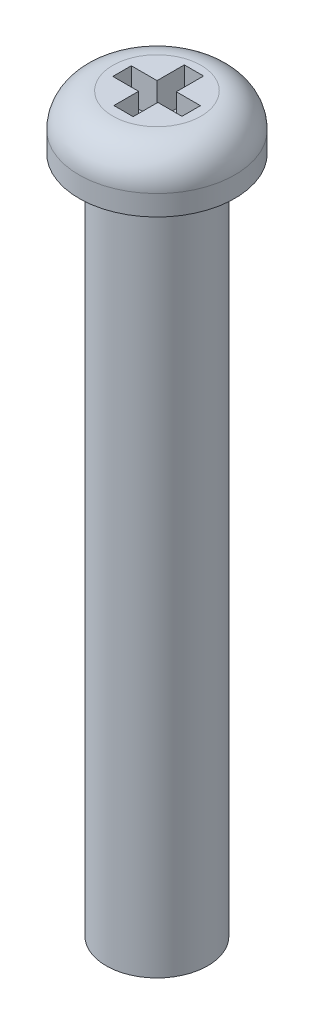
ISO-10303-21;
HEADER;
FILE_DESCRIPTION(('STEP AP214'),'2;1');
FILE_NAME('part.step','',(''),(''),'','','');
FILE_SCHEMA(('AUTOMOTIVE_DESIGN { 1 0 10303 214 1 1 1 1 }'));
ENDSEC;
DATA;
#1=APPLICATION_CONTEXT('core data for automotive mechanical design processes');
#2=APPLICATION_PROTOCOL_DEFINITION('international standard','automotive_design',2000,#1);
#3=PRODUCT_CONTEXT('',#1,'mechanical');
#4=PRODUCT('Part','Part','',(#3));
#5=PRODUCT_RELATED_PRODUCT_CATEGORY('part','',(#4));
#6=PRODUCT_DEFINITION_FORMATION('','',#4);
#7=PRODUCT_DEFINITION_CONTEXT('part definition',#1,'design');
#8=PRODUCT_DEFINITION('design','',#6,#7);
#9=PRODUCT_DEFINITION_SHAPE('','',#8);
#10=(LENGTH_UNIT() NAMED_UNIT(*) SI_UNIT(.MILLI.,.METRE.));
#11=(NAMED_UNIT(*) PLANE_ANGLE_UNIT() SI_UNIT($,.RADIAN.));
#12=(NAMED_UNIT(*) SI_UNIT($,.STERADIAN.) SOLID_ANGLE_UNIT());
#13=UNCERTAINTY_MEASURE_WITH_UNIT(LENGTH_MEASURE(1.E-05),#10,'distance_accuracy_value','');
#14=(GEOMETRIC_REPRESENTATION_CONTEXT(3) GLOBAL_UNCERTAINTY_ASSIGNED_CONTEXT((#13)) GLOBAL_UNIT_ASSIGNED_CONTEXT((#10,
#11,#12)) REPRESENTATION_CONTEXT('',''));
#15=CARTESIAN_POINT('',(0.,0.,0.));
#16=DIRECTION('',(0.,0.,1.));
#17=DIRECTION('',(1.,0.,0.));
#18=AXIS2_PLACEMENT_3D('',#15,#16,#17);
#19=CARTESIAN_POINT('',(0.,0.,0.));
#20=DIRECTION('',(0.,1.,0.));
#21=DIRECTION('',(-1.,0.,0.));
#22=AXIS2_PLACEMENT_3D('',#19,#20,#21);
#23=PLANE('',#22);
#24=CARTESIAN_POINT('',(0.,0.,0.));
#25=DIRECTION('',(0.,1.,0.));
#26=DIRECTION('',(-1.,0.,0.));
#27=AXIS2_PLACEMENT_3D('',#24,#25,#26);
#28=CIRCLE('',#27,1.5);
#29=CARTESIAN_POINT('',(-1.5,0.,0.));
#30=VERTEX_POINT('',#29);
#31=EDGE_CURVE('E11',#30,#30,#28,.T.);
#32=ORIENTED_EDGE('',*,*,#31,.F.);
#33=EDGE_LOOP('',(#32));
#34=FACE_BOUND('',#33,.T.);
#35=ADVANCED_FACE('F33',(#34),#23,.F.);
#36=CARTESIAN_POINT('',(0.,21.6,0.));
#37=DIRECTION('',(0.,1.,0.));
#38=DIRECTION('',(-1.,0.,0.));
#39=AXIS2_PLACEMENT_3D('',#36,#37,#38);
#40=CYLINDRICAL_SURFACE('',#39,1.5);
#41=CARTESIAN_POINT('',(0.,20.,0.));
#42=DIRECTION('',(0.,1.,0.));
#43=DIRECTION('',(-1.,0.,0.));
#44=AXIS2_PLACEMENT_3D('',#41,#42,#43);
#45=CIRCLE('',#44,1.5);
#46=CARTESIAN_POINT('',(-1.5,20.,0.));
#47=VERTEX_POINT('',#46);
#48=EDGE_CURVE('E40',#47,#47,#45,.T.);
#49=ORIENTED_EDGE('',*,*,#48,.F.);
#50=EDGE_LOOP('',(#49));
#51=FACE_BOUND('',#50,.T.);
#52=ORIENTED_EDGE('',*,*,#31,.T.);
#53=EDGE_LOOP('',(#52));
#54=FACE_BOUND('',#53,.T.);
#55=ADVANCED_FACE('F218',(#51,#54),#40,.T.);
#56=CARTESIAN_POINT('',(1.5,20.,0.));
#57=DIRECTION('',(0.,1.,0.));
#58=DIRECTION('',(-1.,0.,0.));
#59=AXIS2_PLACEMENT_3D('',#56,#57,#58);
#60=PLANE('',#59);
#61=CARTESIAN_POINT('',(0.,20.,0.));
#62=DIRECTION('',(0.,1.,0.));
#63=DIRECTION('',(-1.,0.,0.));
#64=AXIS2_PLACEMENT_3D('',#61,#62,#63);
#65=CIRCLE('',#64,2.3);
#66=CARTESIAN_POINT('',(-2.3,20.,0.));
#67=VERTEX_POINT('',#66);
#68=EDGE_CURVE('E211',#67,#67,#65,.T.);
#69=ORIENTED_EDGE('',*,*,#68,.F.);
#70=EDGE_LOOP('',(#69));
#71=FACE_BOUND('',#70,.T.);
#72=ORIENTED_EDGE('',*,*,#48,.T.);
#73=EDGE_LOOP('',(#72));
#74=FACE_BOUND('',#73,.T.);
#75=ADVANCED_FACE('F216',(#71,#74),#60,.F.);
#76=CARTESIAN_POINT('',(0.,21.6,0.));
#77=DIRECTION('',(0.,1.,0.));
#78=DIRECTION('',(-1.,0.,0.));
#79=AXIS2_PLACEMENT_3D('',#76,#77,#78);
#80=CYLINDRICAL_SURFACE('',#79,2.3);
#81=CARTESIAN_POINT('',(0.,20.6,0.));
#82=DIRECTION('',(0.,1.,0.));
#83=DIRECTION('',(-1.,0.,0.));
#84=AXIS2_PLACEMENT_3D('',#81,#82,#83);
#85=CIRCLE('',#84,2.3);
#86=CARTESIAN_POINT('',(-2.3,20.6,0.));
#87=VERTEX_POINT('',#86);
#88=EDGE_CURVE('E208',#87,#87,#85,.T.);
#89=ORIENTED_EDGE('',*,*,#88,.F.);
#90=EDGE_LOOP('',(#89));
#91=FACE_BOUND('',#90,.T.);
#92=ORIENTED_EDGE('',*,*,#68,.T.);
#93=EDGE_LOOP('',(#92));
#94=FACE_BOUND('',#93,.T.);
#95=ADVANCED_FACE('F236',(#91,#94),#80,.T.);
#96=CARTESIAN_POINT('',(0.,20.6,0.));
#97=DIRECTION('',(0.,1.,0.));
#98=DIRECTION('',(-1.,0.,0.));
#99=AXIS2_PLACEMENT_3D('',#96,#97,#98);
#100=TOROIDAL_SURFACE('',#99,1.3,0.999999999999999);
#101=CARTESIAN_POINT('',(0.,21.6,0.));
#102=DIRECTION('',(0.,1.,0.));
#103=DIRECTION('',(-1.,0.,0.));
#104=AXIS2_PLACEMENT_3D('',#101,#102,#103);
#105=CIRCLE('',#104,1.3);
#106=CARTESIAN_POINT('',(-1.3,21.6,0.));
#107=VERTEX_POINT('',#106);
#108=EDGE_CURVE('E188',#107,#107,#105,.T.);
#109=ORIENTED_EDGE('',*,*,#108,.F.);
#110=EDGE_LOOP('',(#109));
#111=FACE_BOUND('',#110,.T.);
#112=ORIENTED_EDGE('',*,*,#88,.T.);
#113=EDGE_LOOP('',(#112));
#114=FACE_BOUND('',#113,.T.);
#115=ADVANCED_FACE('F244',(#111,#114),#100,.T.);
#116=CARTESIAN_POINT('',(1.3,21.6,0.));
#117=DIRECTION('',(0.,-1.,0.));
#118=DIRECTION('',(1.,0.,0.));
#119=AXIS2_PLACEMENT_3D('',#116,#117,#118);
#120=PLANE('',#119);
#121=DIRECTION('',(0.,0.,1.));
#122=VECTOR('',#121,1.);
#123=CARTESIAN_POINT('',(-1.01631222885825,21.6,0.285133972842372));
#124=LINE('',#123,#122);
#125=CARTESIAN_POINT('',(-1.01631222885825,21.6,-0.26020042003905));
#126=VERTEX_POINT('',#125);
#127=CARTESIAN_POINT('',(-1.01631222885825,21.6,0.285133972842372));
#128=VERTEX_POINT('',#127);
#129=EDGE_CURVE('E157',#126,#128,#124,.T.);
#130=ORIENTED_EDGE('',*,*,#129,.F.);
#131=DIRECTION('',(-1.,0.,0.));
#132=VECTOR('',#131,1.);
#133=CARTESIAN_POINT('',(-1.01631222885825,21.6,-0.26020042003905));
#134=LINE('',#133,#132);
#135=CARTESIAN_POINT('',(-0.257139238626786,21.6,-0.26020042003905));
#136=VERTEX_POINT('',#135);
#137=EDGE_CURVE('E47',#136,#126,#134,.T.);
#138=ORIENTED_EDGE('',*,*,#137,.F.);
#139=DIRECTION('',(0.,0.,1.));
#140=VECTOR('',#139,1.);
#141=CARTESIAN_POINT('',(-0.257139238626786,21.6,-0.26020042003905));
#142=LINE('',#141,#140);
#143=CARTESIAN_POINT('',(-0.257139238626786,21.6,-1.06361805132432));
#144=VERTEX_POINT('',#143);
#145=EDGE_CURVE('E184',#144,#136,#142,.T.);
#146=ORIENTED_EDGE('',*,*,#145,.F.);
#147=DIRECTION('',(-1.,0.,0.));
#148=VECTOR('',#147,1.);
#149=CARTESIAN_POINT('',(-0.257139238626786,21.6,-1.06361805132432));
#150=LINE('',#149,#148);
#151=CARTESIAN_POINT('',(0.311378396994885,21.6,-1.06361805132432));
#152=VERTEX_POINT('',#151);
#153=EDGE_CURVE('E182',#152,#144,#150,.T.);
#154=ORIENTED_EDGE('',*,*,#153,.F.);
#155=DIRECTION('',(0.,0.,-1.));
#156=VECTOR('',#155,1.);
#157=CARTESIAN_POINT('',(0.311378396994885,21.6,-1.06361805132432));
#158=LINE('',#157,#156);
#159=CARTESIAN_POINT('',(0.311378396994885,21.6,-0.26020042003905));
#160=VERTEX_POINT('',#159);
#161=EDGE_CURVE('E131',#160,#152,#158,.T.);
#162=ORIENTED_EDGE('',*,*,#161,.F.);
#163=DIRECTION('',(-1.,0.,0.));
#164=VECTOR('',#163,1.);
#165=CARTESIAN_POINT('',(0.311378396994885,21.6,-0.26020042003905));
#166=LINE('',#165,#164);
#167=CARTESIAN_POINT('',(1.02243459168269,21.6,-0.26020042003905));
#168=VERTEX_POINT('',#167);
#169=EDGE_CURVE('E178',#168,#160,#166,.T.);
#170=ORIENTED_EDGE('',*,*,#169,.F.);
#171=DIRECTION('',(0.,0.,-1.));
#172=VECTOR('',#171,1.);
#173=CARTESIAN_POINT('',(1.02243459168269,21.6,-0.26020042003905));
#174=LINE('',#173,#172);
#175=CARTESIAN_POINT('',(1.02243459168269,21.6,0.285133972842372));
#176=VERTEX_POINT('',#175);
#177=EDGE_CURVE('E175',#176,#168,#174,.T.);
#178=ORIENTED_EDGE('',*,*,#177,.F.);
#179=DIRECTION('',(1.,0.,0.));
#180=VECTOR('',#179,1.);
#181=CARTESIAN_POINT('',(1.02243459168269,21.6,0.285133972842372));
#182=LINE('',#181,#180);
#183=CARTESIAN_POINT('',(0.311378396994885,21.6,0.285133972842372));
#184=VERTEX_POINT('',#183);
#185=EDGE_CURVE('E172',#184,#176,#182,.T.);
#186=ORIENTED_EDGE('',*,*,#185,.F.);
#187=DIRECTION('',(0.,0.,-1.));
#188=VECTOR('',#187,1.);
#189=CARTESIAN_POINT('',(0.311378396994885,21.6,0.285133972842372));
#190=LINE('',#189,#188);
#191=CARTESIAN_POINT('',(0.311378396994885,21.6,1.01325104744598));
#192=VERTEX_POINT('',#191);
#193=EDGE_CURVE('E169',#192,#184,#190,.T.);
#194=ORIENTED_EDGE('',*,*,#193,.F.);
#195=DIRECTION('',(1.,0.,0.));
#196=VECTOR('',#195,1.);
#197=CARTESIAN_POINT('',(0.311378396994885,21.6,1.01325104744598));
#198=LINE('',#197,#196);
#199=CARTESIAN_POINT('',(-0.257139238626786,21.6,1.01325104744598));
#200=VERTEX_POINT('',#199);
#201=EDGE_CURVE('E166',#200,#192,#198,.T.);
#202=ORIENTED_EDGE('',*,*,#201,.F.);
#203=DIRECTION('',(0.,0.,1.));
#204=VECTOR('',#203,1.);
#205=CARTESIAN_POINT('',(-0.257139238626786,21.6,1.01325104744598));
#206=LINE('',#205,#204);
#207=CARTESIAN_POINT('',(-0.257139238626786,21.6,0.285133972842372));
#208=VERTEX_POINT('',#207);
#209=EDGE_CURVE('E163',#208,#200,#206,.T.);
#210=ORIENTED_EDGE('',*,*,#209,.F.);
#211=DIRECTION('',(1.,0.,0.));
#212=VECTOR('',#211,1.);
#213=CARTESIAN_POINT('',(-0.257139238626786,21.6,0.285133972842372));
#214=LINE('',#213,#212);
#215=EDGE_CURVE('E160',#128,#208,#214,.T.);
#216=ORIENTED_EDGE('',*,*,#215,.F.);
#217=EDGE_LOOP('',(#130,#138,#146,#154,#162,#170,#178,#186,#194,#202,#210,#216));
#218=FACE_BOUND('',#217,.T.);
#219=ORIENTED_EDGE('',*,*,#108,.T.);
#220=EDGE_LOOP('',(#219));
#221=FACE_BOUND('',#220,.T.);
#222=ADVANCED_FACE('F252',(#218,#221),#120,.F.);
#223=CARTESIAN_POINT('',(-1.01631222885825,20.6,-0.26020042003905));
#224=DIRECTION('',(0.,0.,-1.));
#225=DIRECTION('',(-1.,0.,0.));
#226=AXIS2_PLACEMENT_3D('',#223,#224,#225);
#227=PLANE('',#226);
#228=ORIENTED_EDGE('',*,*,#137,.T.);
#229=DIRECTION('',(0.,1.,0.));
#230=VECTOR('',#229,1.);
#231=CARTESIAN_POINT('',(-1.01631222885825,20.6,-0.26020042003905));
#232=LINE('',#231,#230);
#233=CARTESIAN_POINT('',(-1.01631222885825,20.6,-0.26020042003905));
#234=VERTEX_POINT('',#233);
#235=EDGE_CURVE('E95',#234,#126,#232,.T.);
#236=ORIENTED_EDGE('',*,*,#235,.F.);
#237=DIRECTION('',(-1.,0.,0.));
#238=VECTOR('',#237,1.);
#239=CARTESIAN_POINT('',(-1.01631222885825,20.6,-0.26020042003905));
#240=LINE('',#239,#238);
#241=CARTESIAN_POINT('',(-0.257139238626786,20.6,-0.26020042003905));
#242=VERTEX_POINT('',#241);
#243=EDGE_CURVE('E186',#242,#234,#240,.T.);
#244=ORIENTED_EDGE('',*,*,#243,.F.);
#245=DIRECTION('',(0.,1.,0.));
#246=VECTOR('',#245,1.);
#247=CARTESIAN_POINT('',(-0.257139238626786,20.6,-0.26020042003905));
#248=LINE('',#247,#246);
#249=EDGE_CURVE('E55',#242,#136,#248,.T.);
#250=ORIENTED_EDGE('',*,*,#249,.T.);
#251=EDGE_LOOP('',(#228,#236,#244,#250));
#252=FACE_BOUND('',#251,.T.);
#253=ADVANCED_FACE('F260',(#252),#227,.F.);
#254=CARTESIAN_POINT('',(-0.257139238626786,20.6,-0.26020042003905));
#255=DIRECTION('',(-1.,0.,0.));
#256=DIRECTION('',(0.,-1.,0.));
#257=AXIS2_PLACEMENT_3D('',#254,#255,#256);
#258=PLANE('',#257);
#259=ORIENTED_EDGE('',*,*,#145,.T.);
#260=ORIENTED_EDGE('',*,*,#249,.F.);
#261=DIRECTION('',(0.,0.,1.));
#262=VECTOR('',#261,1.);
#263=CARTESIAN_POINT('',(-0.257139238626786,20.6,-0.26020042003905));
#264=LINE('',#263,#262);
#265=CARTESIAN_POINT('',(-0.257139238626786,20.6,-1.06361805132432));
#266=VERTEX_POINT('',#265);
#267=EDGE_CURVE('E143',#266,#242,#264,.T.);
#268=ORIENTED_EDGE('',*,*,#267,.F.);
#269=DIRECTION('',(0.,1.,0.));
#270=VECTOR('',#269,1.);
#271=CARTESIAN_POINT('',(-0.257139238626786,20.6,-1.06361805132432));
#272=LINE('',#271,#270);
#273=EDGE_CURVE('E135',#266,#144,#272,.T.);
#274=ORIENTED_EDGE('',*,*,#273,.T.);
#275=EDGE_LOOP('',(#259,#260,#268,#274));
#276=FACE_BOUND('',#275,.T.);
#277=ADVANCED_FACE('F268',(#276),#258,.F.);
#278=CARTESIAN_POINT('',(-0.257139238626786,20.6,-1.06361805132432));
#279=DIRECTION('',(0.,0.,-1.));
#280=DIRECTION('',(-1.,0.,0.));
#281=AXIS2_PLACEMENT_3D('',#278,#279,#280);
#282=PLANE('',#281);
#283=ORIENTED_EDGE('',*,*,#153,.T.);
#284=ORIENTED_EDGE('',*,*,#273,.F.);
#285=DIRECTION('',(-1.,0.,0.));
#286=VECTOR('',#285,1.);
#287=CARTESIAN_POINT('',(-0.257139238626786,20.6,-1.06361805132432));
#288=LINE('',#287,#286);
#289=CARTESIAN_POINT('',(0.311378396994885,20.6,-1.06361805132432));
#290=VERTEX_POINT('',#289);
#291=EDGE_CURVE('E139',#290,#266,#288,.T.);
#292=ORIENTED_EDGE('',*,*,#291,.F.);
#293=DIRECTION('',(0.,1.,0.));
#294=VECTOR('',#293,1.);
#295=CARTESIAN_POINT('',(0.311378396994885,20.6,-1.06361805132432));
#296=LINE('',#295,#294);
#297=EDGE_CURVE('E124',#290,#152,#296,.T.);
#298=ORIENTED_EDGE('',*,*,#297,.T.);
#299=EDGE_LOOP('',(#283,#284,#292,#298));
#300=FACE_BOUND('',#299,.T.);
#301=ADVANCED_FACE('F140',(#300),#282,.F.);
#302=CARTESIAN_POINT('',(0.311378396994885,20.6,-1.06361805132432));
#303=DIRECTION('',(1.,0.,0.));
#304=DIRECTION('',(0.,1.,0.));
#305=AXIS2_PLACEMENT_3D('',#302,#303,#304);
#306=PLANE('',#305);
#307=ORIENTED_EDGE('',*,*,#161,.T.);
#308=ORIENTED_EDGE('',*,*,#297,.F.);
#309=DIRECTION('',(0.,0.,-1.));
#310=VECTOR('',#309,1.);
#311=CARTESIAN_POINT('',(0.311378396994885,20.6,-1.06361805132432));
#312=LINE('',#311,#310);
#313=CARTESIAN_POINT('',(0.311378396994885,20.6,-0.26020042003905));
#314=VERTEX_POINT('',#313);
#315=EDGE_CURVE('E128',#314,#290,#312,.T.);
#316=ORIENTED_EDGE('',*,*,#315,.F.);
#317=DIRECTION('',(0.,1.,0.));
#318=VECTOR('',#317,1.);
#319=CARTESIAN_POINT('',(0.311378396994885,20.6,-0.26020042003905));
#320=LINE('',#319,#318);
#321=EDGE_CURVE('E136',#314,#160,#320,.T.);
#322=ORIENTED_EDGE('',*,*,#321,.T.);
#323=EDGE_LOOP('',(#307,#308,#316,#322));
#324=FACE_BOUND('',#323,.T.);
#325=ADVANCED_FACE('F126',(#324),#306,.F.);
#326=CARTESIAN_POINT('',(0.311378396994885,20.6,-0.26020042003905));
#327=DIRECTION('',(0.,0.,-1.));
#328=DIRECTION('',(-1.,0.,0.));
#329=AXIS2_PLACEMENT_3D('',#326,#327,#328);
#330=PLANE('',#329);
#331=ORIENTED_EDGE('',*,*,#169,.T.);
#332=ORIENTED_EDGE('',*,*,#321,.F.);
#333=DIRECTION('',(-1.,0.,0.));
#334=VECTOR('',#333,1.);
#335=CARTESIAN_POINT('',(0.311378396994885,20.6,-0.26020042003905));
#336=LINE('',#335,#334);
#337=CARTESIAN_POINT('',(1.02243459168269,20.6,-0.26020042003905));
#338=VERTEX_POINT('',#337);
#339=EDGE_CURVE('E149',#338,#314,#336,.T.);
#340=ORIENTED_EDGE('',*,*,#339,.F.);
#341=DIRECTION('',(0.,1.,0.));
#342=VECTOR('',#341,1.);
#343=CARTESIAN_POINT('',(1.02243459168269,20.6,-0.26020042003905));
#344=LINE('',#343,#342);
#345=EDGE_CURVE('E191',#338,#168,#344,.T.);
#346=ORIENTED_EDGE('',*,*,#345,.T.);
#347=EDGE_LOOP('',(#331,#332,#340,#346));
#348=FACE_BOUND('',#347,.T.);
#349=ADVANCED_FACE('F287',(#348),#330,.F.);
#350=CARTESIAN_POINT('',(1.02243459168269,20.6,-0.26020042003905));
#351=DIRECTION('',(1.,0.,0.));
#352=DIRECTION('',(0.,1.,0.));
#353=AXIS2_PLACEMENT_3D('',#350,#351,#352);
#354=PLANE('',#353);
#355=ORIENTED_EDGE('',*,*,#177,.T.);
#356=ORIENTED_EDGE('',*,*,#345,.F.);
#357=DIRECTION('',(0.,0.,-1.));
#358=VECTOR('',#357,1.);
#359=CARTESIAN_POINT('',(1.02243459168269,20.6,-0.26020042003905));
#360=LINE('',#359,#358);
#361=CARTESIAN_POINT('',(1.02243459168269,20.6,0.285133972842372));
#362=VERTEX_POINT('',#361);
#363=EDGE_CURVE('E151',#362,#338,#360,.T.);
#364=ORIENTED_EDGE('',*,*,#363,.F.);
#365=DIRECTION('',(0.,1.,0.));
#366=VECTOR('',#365,1.);
#367=CARTESIAN_POINT('',(1.02243459168269,20.6,0.285133972842372));
#368=LINE('',#367,#366);
#369=EDGE_CURVE('E193',#362,#176,#368,.T.);
#370=ORIENTED_EDGE('',*,*,#369,.T.);
#371=EDGE_LOOP('',(#355,#356,#364,#370));
#372=FACE_BOUND('',#371,.T.);
#373=ADVANCED_FACE('F294',(#372),#354,.F.);
#374=CARTESIAN_POINT('',(1.02243459168269,20.6,0.285133972842372));
#375=DIRECTION('',(0.,0.,1.));
#376=DIRECTION('',(1.,0.,0.));
#377=AXIS2_PLACEMENT_3D('',#374,#375,#376);
#378=PLANE('',#377);
#379=ORIENTED_EDGE('',*,*,#185,.T.);
#380=ORIENTED_EDGE('',*,*,#369,.F.);
#381=DIRECTION('',(1.,0.,0.));
#382=VECTOR('',#381,1.);
#383=CARTESIAN_POINT('',(1.02243459168269,20.6,0.285133972842372));
#384=LINE('',#383,#382);
#385=CARTESIAN_POINT('',(0.311378396994885,20.6,0.285133972842372));
#386=VERTEX_POINT('',#385);
#387=EDGE_CURVE('E421',#386,#362,#384,.T.);
#388=ORIENTED_EDGE('',*,*,#387,.F.);
#389=DIRECTION('',(0.,1.,0.));
#390=VECTOR('',#389,1.);
#391=CARTESIAN_POINT('',(0.311378396994885,20.6,0.285133972842372));
#392=LINE('',#391,#390);
#393=EDGE_CURVE('E195',#386,#184,#392,.T.);
#394=ORIENTED_EDGE('',*,*,#393,.T.);
#395=EDGE_LOOP('',(#379,#380,#388,#394));
#396=FACE_BOUND('',#395,.T.);
#397=ADVANCED_FACE('F302',(#396),#378,.F.);
#398=CARTESIAN_POINT('',(0.311378396994885,20.6,0.285133972842372));
#399=DIRECTION('',(1.,0.,0.));
#400=DIRECTION('',(0.,1.,0.));
#401=AXIS2_PLACEMENT_3D('',#398,#399,#400);
#402=PLANE('',#401);
#403=ORIENTED_EDGE('',*,*,#193,.T.);
#404=ORIENTED_EDGE('',*,*,#393,.F.);
#405=DIRECTION('',(0.,0.,-1.));
#406=VECTOR('',#405,1.);
#407=CARTESIAN_POINT('',(0.311378396994885,20.6,0.285133972842372));
#408=LINE('',#407,#406);
#409=CARTESIAN_POINT('',(0.311378396994885,20.6,1.01325104744598));
#410=VERTEX_POINT('',#409);
#411=EDGE_CURVE('E418',#410,#386,#408,.T.);
#412=ORIENTED_EDGE('',*,*,#411,.F.);
#413=DIRECTION('',(0.,1.,0.));
#414=VECTOR('',#413,1.);
#415=CARTESIAN_POINT('',(0.311378396994885,20.6,1.01325104744598));
#416=LINE('',#415,#414);
#417=EDGE_CURVE('E197',#410,#192,#416,.T.);
#418=ORIENTED_EDGE('',*,*,#417,.T.);
#419=EDGE_LOOP('',(#403,#404,#412,#418));
#420=FACE_BOUND('',#419,.T.);
#421=ADVANCED_FACE('F310',(#420),#402,.F.);
#422=CARTESIAN_POINT('',(0.311378396994885,20.6,1.01325104744598));
#423=DIRECTION('',(0.,0.,1.));
#424=DIRECTION('',(1.,0.,0.));
#425=AXIS2_PLACEMENT_3D('',#422,#423,#424);
#426=PLANE('',#425);
#427=ORIENTED_EDGE('',*,*,#201,.T.);
#428=ORIENTED_EDGE('',*,*,#417,.F.);
#429=DIRECTION('',(1.,0.,0.));
#430=VECTOR('',#429,1.);
#431=CARTESIAN_POINT('',(0.311378396994885,20.6,1.01325104744598));
#432=LINE('',#431,#430);
#433=CARTESIAN_POINT('',(-0.257139238626786,20.6,1.01325104744598));
#434=VERTEX_POINT('',#433);
#435=EDGE_CURVE('E415',#434,#410,#432,.T.);
#436=ORIENTED_EDGE('',*,*,#435,.F.);
#437=DIRECTION('',(0.,1.,0.));
#438=VECTOR('',#437,1.);
#439=CARTESIAN_POINT('',(-0.257139238626786,20.6,1.01325104744598));
#440=LINE('',#439,#438);
#441=EDGE_CURVE('E199',#434,#200,#440,.T.);
#442=ORIENTED_EDGE('',*,*,#441,.T.);
#443=EDGE_LOOP('',(#427,#428,#436,#442));
#444=FACE_BOUND('',#443,.T.);
#445=ADVANCED_FACE('F318',(#444),#426,.F.);
#446=CARTESIAN_POINT('',(-0.257139238626786,20.6,1.01325104744598));
#447=DIRECTION('',(-1.,0.,0.));
#448=DIRECTION('',(0.,-1.,0.));
#449=AXIS2_PLACEMENT_3D('',#446,#447,#448);
#450=PLANE('',#449);
#451=ORIENTED_EDGE('',*,*,#209,.T.);
#452=ORIENTED_EDGE('',*,*,#441,.F.);
#453=DIRECTION('',(0.,0.,1.));
#454=VECTOR('',#453,1.);
#455=CARTESIAN_POINT('',(-0.257139238626786,20.6,1.01325104744598));
#456=LINE('',#455,#454);
#457=CARTESIAN_POINT('',(-0.257139238626786,20.6,0.285133972842372));
#458=VERTEX_POINT('',#457);
#459=EDGE_CURVE('E408',#458,#434,#456,.T.);
#460=ORIENTED_EDGE('',*,*,#459,.F.);
#461=DIRECTION('',(0.,1.,0.));
#462=VECTOR('',#461,1.);
#463=CARTESIAN_POINT('',(-0.257139238626786,20.6,0.285133972842372));
#464=LINE('',#463,#462);
#465=EDGE_CURVE('E201',#458,#208,#464,.T.);
#466=ORIENTED_EDGE('',*,*,#465,.T.);
#467=EDGE_LOOP('',(#451,#452,#460,#466));
#468=FACE_BOUND('',#467,.T.);
#469=ADVANCED_FACE('F326',(#468),#450,.F.);
#470=CARTESIAN_POINT('',(-0.257139238626786,20.6,0.285133972842372));
#471=DIRECTION('',(0.,0.,1.));
#472=DIRECTION('',(1.,0.,0.));
#473=AXIS2_PLACEMENT_3D('',#470,#471,#472);
#474=PLANE('',#473);
#475=ORIENTED_EDGE('',*,*,#215,.T.);
#476=ORIENTED_EDGE('',*,*,#465,.F.);
#477=DIRECTION('',(1.,0.,0.));
#478=VECTOR('',#477,1.);
#479=CARTESIAN_POINT('',(-0.257139238626786,20.6,0.285133972842372));
#480=LINE('',#479,#478);
#481=CARTESIAN_POINT('',(-1.01631222885825,20.6,0.285133972842372));
#482=VERTEX_POINT('',#481);
#483=EDGE_CURVE('E405',#482,#458,#480,.T.);
#484=ORIENTED_EDGE('',*,*,#483,.F.);
#485=DIRECTION('',(0.,1.,0.));
#486=VECTOR('',#485,1.);
#487=CARTESIAN_POINT('',(-1.01631222885825,20.6,0.285133972842372));
#488=LINE('',#487,#486);
#489=EDGE_CURVE('E203',#482,#128,#488,.T.);
#490=ORIENTED_EDGE('',*,*,#489,.T.);
#491=EDGE_LOOP('',(#475,#476,#484,#490));
#492=FACE_BOUND('',#491,.T.);
#493=ADVANCED_FACE('F334',(#492),#474,.F.);
#494=CARTESIAN_POINT('',(-1.01631222885825,20.6,0.285133972842372));
#495=DIRECTION('',(-1.,0.,0.));
#496=DIRECTION('',(0.,-1.,0.));
#497=AXIS2_PLACEMENT_3D('',#494,#495,#496);
#498=PLANE('',#497);
#499=ORIENTED_EDGE('',*,*,#129,.T.);
#500=ORIENTED_EDGE('',*,*,#489,.F.);
#501=DIRECTION('',(0.,0.,1.));
#502=VECTOR('',#501,1.);
#503=CARTESIAN_POINT('',(-1.01631222885825,20.6,0.285133972842372));
#504=LINE('',#503,#502);
#505=EDGE_CURVE('E409',#234,#482,#504,.T.);
#506=ORIENTED_EDGE('',*,*,#505,.F.);
#507=ORIENTED_EDGE('',*,*,#235,.T.);
#508=EDGE_LOOP('',(#499,#500,#506,#507));
#509=FACE_BOUND('',#508,.T.);
#510=ADVANCED_FACE('F342',(#509),#498,.F.);
#511=CARTESIAN_POINT('',(0.,20.6,0.));
#512=DIRECTION('',(0.,1.,0.));
#513=DIRECTION('',(0.,0.,1.));
#514=AXIS2_PLACEMENT_3D('',#511,#512,#513);
#515=PLANE('',#514);
#516=ORIENTED_EDGE('',*,*,#243,.T.);
#517=ORIENTED_EDGE('',*,*,#505,.T.);
#518=ORIENTED_EDGE('',*,*,#483,.T.);
#519=ORIENTED_EDGE('',*,*,#459,.T.);
#520=ORIENTED_EDGE('',*,*,#435,.T.);
#521=ORIENTED_EDGE('',*,*,#411,.T.);
#522=ORIENTED_EDGE('',*,*,#387,.T.);
#523=ORIENTED_EDGE('',*,*,#363,.T.);
#524=ORIENTED_EDGE('',*,*,#339,.T.);
#525=ORIENTED_EDGE('',*,*,#315,.T.);
#526=ORIENTED_EDGE('',*,*,#291,.T.);
#527=ORIENTED_EDGE('',*,*,#267,.T.);
#528=EDGE_LOOP('',(#516,#517,#518,#519,#520,#521,#522,#523,#524,#525,#526,#527));
#529=FACE_BOUND('',#528,.T.);
#530=ADVANCED_FACE('F146',(#529),#515,.T.);
#531=CLOSED_SHELL('',(#35,#55,#75,#95,#115,#222,#253,#277,#301,#325,#349,#373,#397,#421,#445,
#469,#493,#510,#530));
#532=MANIFOLD_SOLID_BREP('B2',#531);
#533=ADVANCED_BREP_SHAPE_REPRESENTATION('',(#18,#532),#14);
#534=SHAPE_DEFINITION_REPRESENTATION(#9,#533);
ENDSEC;
END-ISO-10303-21;
